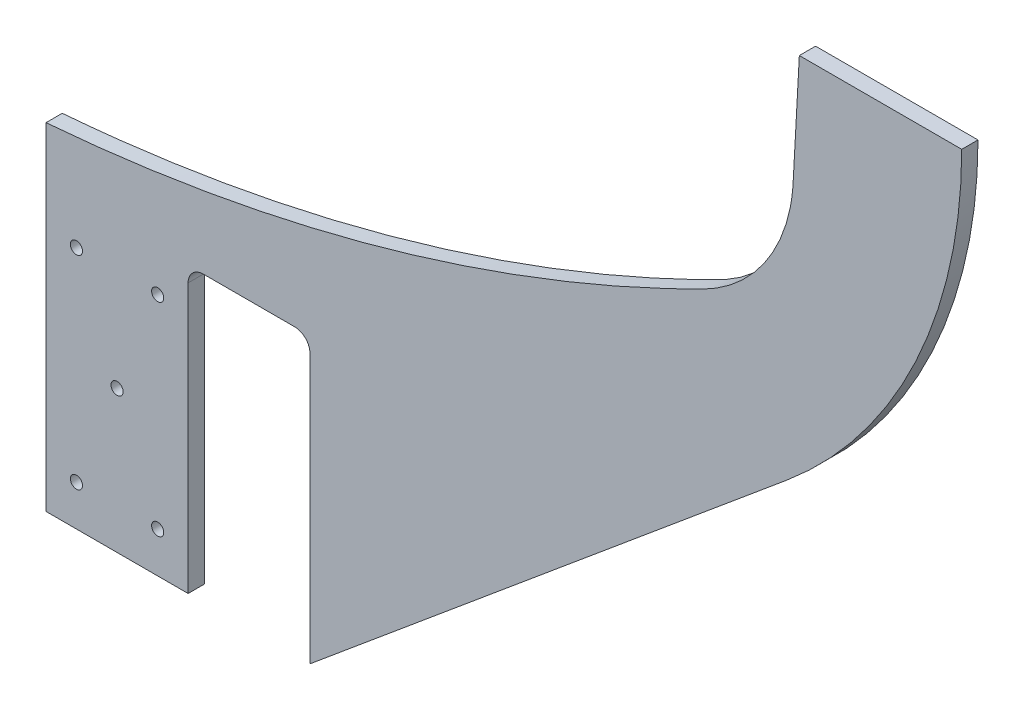
ISO-10303-21;
HEADER;
FILE_DESCRIPTION(('STEP AP214'),'2;1');
FILE_NAME('part.step','',(''),(''),'','','');
FILE_SCHEMA(('AUTOMOTIVE_DESIGN { 1 0 10303 214 1 1 1 1 }'));
ENDSEC;
DATA;
#1=APPLICATION_CONTEXT('core data for automotive mechanical design processes');
#2=APPLICATION_PROTOCOL_DEFINITION('international standard','automotive_design',2000,#1);
#3=PRODUCT_CONTEXT('',#1,'mechanical');
#4=PRODUCT('Part','Part','',(#3));
#5=PRODUCT_RELATED_PRODUCT_CATEGORY('part','',(#4));
#6=PRODUCT_DEFINITION_FORMATION('','',#4);
#7=PRODUCT_DEFINITION_CONTEXT('part definition',#1,'design');
#8=PRODUCT_DEFINITION('design','',#6,#7);
#9=PRODUCT_DEFINITION_SHAPE('','',#8);
#10=(LENGTH_UNIT() NAMED_UNIT(*) SI_UNIT(.MILLI.,.METRE.));
#11=(NAMED_UNIT(*) PLANE_ANGLE_UNIT() SI_UNIT($,.RADIAN.));
#12=(NAMED_UNIT(*) SI_UNIT($,.STERADIAN.) SOLID_ANGLE_UNIT());
#13=UNCERTAINTY_MEASURE_WITH_UNIT(LENGTH_MEASURE(1.E-05),#10,'distance_accuracy_value','');
#14=(GEOMETRIC_REPRESENTATION_CONTEXT(3) GLOBAL_UNCERTAINTY_ASSIGNED_CONTEXT((#13)) GLOBAL_UNIT_ASSIGNED_CONTEXT((#10,
#11,#12)) REPRESENTATION_CONTEXT('',''));
#15=CARTESIAN_POINT('',(0.,0.,0.));
#16=DIRECTION('',(0.,0.,1.));
#17=DIRECTION('',(1.,0.,0.));
#18=AXIS2_PLACEMENT_3D('',#15,#16,#17);
#19=CARTESIAN_POINT('',(282.822547315965,0.,172.72));
#20=CARTESIAN_POINT('',(281.917432252256,-16.716201741748,172.72));
#21=CARTESIAN_POINT('',(281.009042384406,-33.4322254897038,172.72));
#22=CARTESIAN_POINT('',(279.642521658059,-58.5060471842973,172.72));
#23=CARTESIAN_POINT('',(279.186465158858,-66.863956695634,172.72));
#24=CARTESIAN_POINT('',(278.6164879358,-77.3113479059404,172.72));
#25=CARTESIAN_POINT('',(278.44550483703,-80.4455658967186,172.72));
#26=CARTESIAN_POINT('',(278.274559114764,-83.5797862176887,172.72));
#27=CARTESIAN_POINT('',(278.160605711418,-85.6692670807608,172.72));
#28=CARTESIAN_POINT('',(278.111826830943,-86.7145185953383,172.72));
#29=CARTESIAN_POINT('',(277.933937907453,-88.8000134773418,172.72));
#30=CARTESIAN_POINT('',(277.81274561256,-89.840750466999,172.72));
#31=CARTESIAN_POINT('',(277.505129205835,-91.9181576492215,172.72));
#32=CARTESIAN_POINT('',(277.319133397582,-92.9510139970632,172.72));
#33=CARTESIAN_POINT('',(276.670317019009,-96.0123633764514,172.72));
#34=CARTESIAN_POINT('',(276.11604168694,-98.0121269853969,172.72));
#35=CARTESIAN_POINT('',(274.770500867277,-101.931569300678,172.72));
#36=CARTESIAN_POINT('',(273.97880080892,-103.851101154682,172.72));
#37=CARTESIAN_POINT('',(272.607912550155,-106.668444380845,172.72));
#38=CARTESIAN_POINT('',(272.118462854082,-107.600376740023,172.72));
#39=CARTESIAN_POINT('',(271.087513772088,-109.424466313284,172.72));
#40=CARTESIAN_POINT('',(270.546450149901,-110.316517342708,172.72));
#41=CARTESIAN_POINT('',(268.848193810457,-112.934018819833,172.72));
#42=CARTESIAN_POINT('',(267.616149058274,-114.600984423875,172.72));
#43=CARTESIAN_POINT('',(264.95365386577,-117.779893451686,172.72));
#44=CARTESIAN_POINT('',(263.523342806333,-119.291945779231,172.72));
#45=CARTESIAN_POINT('',(261.224264038492,-121.440001023838,172.72));
#46=CARTESIAN_POINT('',(260.434591495671,-122.133522085225,172.72));
#47=CARTESIAN_POINT('',(258.824774339137,-123.462748371786,172.72));
#48=CARTESIAN_POINT('',(258.002420054399,-124.100536933576,172.72));
#49=CARTESIAN_POINT('',(255.483699130975,-125.934472984522,172.72));
#50=CARTESIAN_POINT('',(253.735859311784,-127.051475124801,172.72));
#51=CARTESIAN_POINT('',(251.465022087965,-128.3154363055,172.72));
#52=CARTESIAN_POINT('',(251.006539799165,-128.561594021813,172.72));
#53=CARTESIAN_POINT('',(250.080879075368,-129.040538228532,172.72));
#54=CARTESIAN_POINT('',(249.613678067462,-129.273290010752,172.72));
#55=CARTESIAN_POINT('',(248.214811365788,-129.975752736103,172.72));
#56=CARTESIAN_POINT('',(247.280452407282,-130.441654298831,172.72));
#57=CARTESIAN_POINT('',(244.47385592022,-131.83122795591,172.72));
#58=CARTESIAN_POINT('',(242.598324524224,-132.746663613543,172.72));
#59=CARTESIAN_POINT('',(225.678493709402,-140.887444301194,172.72));
#60=CARTESIAN_POINT('',(210.355002011749,-147.428614762706,172.72));
#61=CARTESIAN_POINT('',(186.945059573838,-156.199609990324,172.72));
#62=CARTESIAN_POINT('',(179.070432736322,-158.949218628526,172.72));
#63=CARTESIAN_POINT('',(163.179835439167,-164.099264465208,172.72));
#64=CARTESIAN_POINT('',(155.204838431599,-166.486485556579,172.72));
#65=CARTESIAN_POINT('',(131.192189377069,-173.093830710618,172.72));
#66=CARTESIAN_POINT('',(115.06656409433,-176.757643415865,172.72));
#67=CARTESIAN_POINT('',(82.586333401069,-182.637280190018,172.72));
#68=CARTESIAN_POINT('',(66.2317036209634,-184.852950154366,172.72));
#69=CARTESIAN_POINT('',(33.2906371717537,-187.818426017268,172.72));
#70=CARTESIAN_POINT('',(16.7048995493728,-188.572652437908,172.72));
#71=CARTESIAN_POINT('',(0.,-188.573341344875,172.72));
#72=B_SPLINE_CURVE_WITH_KNOTS('',3,(#19,#20,#21,#22,#23,#24,#25,#26,#27,#28,#29,#30,#31,#32,#33,
#34,#35,#36,#37,#38,#39,#40,#41,#42,#43,#44,#45,#46,#47,#48,#49,#50,#51,#52,#53,#54,#55,#56,#57,
#58,#59,#60,#61,#62,#63,#64,#65,#66,#67,#68,#69,#70,#71),.UNSPECIFIED.,.F.,.F.,(4,2,2,1,2,2,2,2,
2,2,2,2,2,2,2,2,2,2,2,2,2,2,2,2,2,2,4),(0.,0.124999999999994,0.187499999999991,
0.203124999999991,0.21093749999999,0.21874999999999,0.226562499999989,0.234374999999989,
0.249999999999989,0.265624999999988,0.273437499999988,0.281249999999987,0.296874999999987,
0.312499999999986,0.320312499999986,0.328124999999986,0.343749999999986,0.347656249999986,
0.351562499999986,0.359374999999986,0.374999999999986,0.499999999999989,0.56249999999999,
0.624999999999992,0.749999999999994,0.874999999999997,1.),.UNSPECIFIED.);
#73=DIRECTION('',(0.,0.,1.));
#74=VECTOR('',#73,1.);
#75=SURFACE_OF_LINEAR_EXTRUSION('',#72,#74);
#76=CARTESIAN_POINT('',(44.4500015628081,-186.788215495495,177.8));
#77=CARTESIAN_POINT('',(46.2217234840443,-186.645798079056,177.8));
#78=CARTESIAN_POINT('',(47.9921114606454,-186.494945272647,177.8));
#79=CARTESIAN_POINT('',(66.2317036209634,-184.852950154366,177.8));
#80=CARTESIAN_POINT('',(82.586333401069,-182.637280190018,177.8));
#81=CARTESIAN_POINT('',(115.06656409433,-176.757643415865,177.8));
#82=CARTESIAN_POINT('',(131.192189377069,-173.093830710618,177.8));
#83=CARTESIAN_POINT('',(155.204838431599,-166.486485556579,177.8));
#84=CARTESIAN_POINT('',(163.179835439167,-164.099264465208,177.8));
#85=CARTESIAN_POINT('',(179.070432736322,-158.949218628526,177.8));
#86=CARTESIAN_POINT('',(186.945059573838,-156.199609990324,177.8));
#87=CARTESIAN_POINT('',(210.355002011749,-147.428614762706,177.8));
#88=CARTESIAN_POINT('',(225.678493709402,-140.887444301194,177.8));
#89=CARTESIAN_POINT('',(242.598324524224,-132.746663613543,177.8));
#90=CARTESIAN_POINT('',(244.47385592022,-131.83122795591,177.8));
#91=CARTESIAN_POINT('',(247.280452407282,-130.441654298831,177.8));
#92=CARTESIAN_POINT('',(248.214811365788,-129.975752736103,177.8));
#93=CARTESIAN_POINT('',(249.613678067462,-129.273290010752,177.8));
#94=CARTESIAN_POINT('',(250.080879075368,-129.040538228532,177.8));
#95=CARTESIAN_POINT('',(251.006539799165,-128.561594021813,177.8));
#96=CARTESIAN_POINT('',(251.465022087965,-128.3154363055,177.8));
#97=CARTESIAN_POINT('',(253.735859311784,-127.051475124801,177.8));
#98=CARTESIAN_POINT('',(255.483699130975,-125.934472984522,177.8));
#99=CARTESIAN_POINT('',(258.002420054399,-124.100536933576,177.8));
#100=CARTESIAN_POINT('',(258.824774339137,-123.462748371786,177.8));
#101=CARTESIAN_POINT('',(260.434591495671,-122.133522085225,177.8));
#102=CARTESIAN_POINT('',(261.224264038492,-121.440001023838,177.8));
#103=CARTESIAN_POINT('',(263.523342806333,-119.291945779231,177.8));
#104=CARTESIAN_POINT('',(264.95365386577,-117.779893451686,177.8));
#105=CARTESIAN_POINT('',(267.616149058274,-114.600984423875,177.8));
#106=CARTESIAN_POINT('',(268.848193810457,-112.934018819833,177.8));
#107=CARTESIAN_POINT('',(270.546450149901,-110.316517342708,177.8));
#108=CARTESIAN_POINT('',(271.087513772088,-109.424466313284,177.8));
#109=CARTESIAN_POINT('',(272.118462854082,-107.600376740023,177.8));
#110=CARTESIAN_POINT('',(272.607912550155,-106.668444380845,177.8));
#111=CARTESIAN_POINT('',(273.97880080892,-103.851101154682,177.8));
#112=CARTESIAN_POINT('',(274.770500867277,-101.931569300678,177.8));
#113=CARTESIAN_POINT('',(276.11604168694,-98.0121269853969,177.8));
#114=CARTESIAN_POINT('',(276.670317019009,-96.0123633764514,177.8));
#115=CARTESIAN_POINT('',(277.319133397582,-92.9510139970632,177.8));
#116=CARTESIAN_POINT('',(277.505129205835,-91.9181576492215,177.8));
#117=CARTESIAN_POINT('',(277.81274561256,-89.840750466999,177.8));
#118=CARTESIAN_POINT('',(277.933937907453,-88.8000134773418,177.8));
#119=CARTESIAN_POINT('',(278.111826830943,-86.7145185953383,177.8));
#120=CARTESIAN_POINT('',(278.160605711418,-85.6692670807608,177.8));
#121=CARTESIAN_POINT('',(278.274559114764,-83.5797862176887,177.8));
#122=CARTESIAN_POINT('',(278.44550483703,-80.4455658967186,177.8));
#123=CARTESIAN_POINT('',(278.6164879358,-77.3113479059404,177.8));
#124=CARTESIAN_POINT('',(279.174610104009,-67.0812537924612,177.8));
#125=CARTESIAN_POINT('',(279.618807713543,-58.9406412005363,177.8));
#126=CARTESIAN_POINT('',(280.062499337146,-50.8,177.8));
#127=B_SPLINE_CURVE_WITH_KNOTS('',3,(#76,#77,#78,#79,#80,#81,#82,#83,#84,#85,#86,#87,#88,#89,
#90,#91,#92,#93,#94,#95,#96,#97,#98,#99,#100,#101,#102,#103,#104,#105,#106,#107,#108,#109,#110,
#111,#112,#113,#114,#115,#116,#117,#118,#119,#120,#121,#122,#123,#124,#125,#126),.UNSPECIFIED.,
.F.,.F.,(4,2,2,2,2,2,2,2,2,2,2,2,2,2,2,2,2,2,2,2,2,2,2,1,2,4),(0.126624935387967,
0.140050873938263,0.265050873938265,0.390050873938268,0.45255087393827,0.515050873938271,
0.640050873938273,0.655675873938274,0.663488373938274,0.667394623938274,0.671300873938274,
0.686925873938274,0.694738373938274,0.702550873938273,0.718175873938273,0.733800873938272,
0.741613373938272,0.749425873938272,0.765050873938271,0.780675873938271,0.78848837393827,
0.79630087393827,0.80411337393827,0.811925873938269,0.827550873938268,0.888425938550293),.UNSPECIFIED.);
#128=CARTESIAN_POINT('',(280.062499337146,-50.8,177.8));
#129=VERTEX_POINT('',#128);
#130=CARTESIAN_POINT('',(44.4500015628102,-186.788215495495,177.8));
#131=VERTEX_POINT('',#130);
#132=EDGE_CURVE('E130',#129,#131,#127,.F.);
#133=ORIENTED_EDGE('',*,*,#132,.F.);
#134=DIRECTION('',(0.,0.,1.));
#135=VECTOR('',#134,1.);
#136=CARTESIAN_POINT('',(280.062499337146,-50.8,172.72));
#137=LINE('',#136,#135);
#138=CARTESIAN_POINT('',(280.062499337146,-50.8,172.72));
#139=VERTEX_POINT('',#138);
#140=EDGE_CURVE('E123',#139,#129,#137,.T.);
#141=ORIENTED_EDGE('',*,*,#140,.F.);
#142=CARTESIAN_POINT('',(280.062499337146,-50.8,172.72));
#143=CARTESIAN_POINT('',(279.618807713543,-58.9406412005363,172.72));
#144=CARTESIAN_POINT('',(279.174610104009,-67.0812537924612,172.72));
#145=CARTESIAN_POINT('',(278.6164879358,-77.3113479059404,172.72));
#146=CARTESIAN_POINT('',(278.44550483703,-80.4455658967186,172.72));
#147=CARTESIAN_POINT('',(278.274559114764,-83.5797862176887,172.72));
#148=CARTESIAN_POINT('',(278.160605711418,-85.6692670807608,172.72));
#149=CARTESIAN_POINT('',(278.111826830943,-86.7145185953383,172.72));
#150=CARTESIAN_POINT('',(277.933937907453,-88.8000134773418,172.72));
#151=CARTESIAN_POINT('',(277.81274561256,-89.840750466999,172.72));
#152=CARTESIAN_POINT('',(277.505129205835,-91.9181576492215,172.72));
#153=CARTESIAN_POINT('',(277.319133397582,-92.9510139970632,172.72));
#154=CARTESIAN_POINT('',(276.670317019009,-96.0123633764514,172.72));
#155=CARTESIAN_POINT('',(276.11604168694,-98.0121269853969,172.72));
#156=CARTESIAN_POINT('',(274.770500867277,-101.931569300678,172.72));
#157=CARTESIAN_POINT('',(273.97880080892,-103.851101154682,172.72));
#158=CARTESIAN_POINT('',(272.607912550155,-106.668444380845,172.72));
#159=CARTESIAN_POINT('',(272.118462854082,-107.600376740023,172.72));
#160=CARTESIAN_POINT('',(271.087513772088,-109.424466313284,172.72));
#161=CARTESIAN_POINT('',(270.546450149901,-110.316517342708,172.72));
#162=CARTESIAN_POINT('',(268.848193810457,-112.934018819833,172.72));
#163=CARTESIAN_POINT('',(267.616149058274,-114.600984423875,172.72));
#164=CARTESIAN_POINT('',(264.95365386577,-117.779893451686,172.72));
#165=CARTESIAN_POINT('',(263.523342806333,-119.291945779231,172.72));
#166=CARTESIAN_POINT('',(261.224264038492,-121.440001023838,172.72));
#167=CARTESIAN_POINT('',(260.434591495671,-122.133522085225,172.72));
#168=CARTESIAN_POINT('',(258.824774339137,-123.462748371786,172.72));
#169=CARTESIAN_POINT('',(258.002420054399,-124.100536933576,172.72));
#170=CARTESIAN_POINT('',(255.483699130975,-125.934472984522,172.72));
#171=CARTESIAN_POINT('',(253.735859311784,-127.051475124801,172.72));
#172=CARTESIAN_POINT('',(251.465022087965,-128.3154363055,172.72));
#173=CARTESIAN_POINT('',(251.006539799165,-128.561594021813,172.72));
#174=CARTESIAN_POINT('',(250.080879075368,-129.040538228532,172.72));
#175=CARTESIAN_POINT('',(249.613678067462,-129.273290010752,172.72));
#176=CARTESIAN_POINT('',(248.214811365788,-129.975752736103,172.72));
#177=CARTESIAN_POINT('',(247.280452407282,-130.441654298831,172.72));
#178=CARTESIAN_POINT('',(244.47385592022,-131.83122795591,172.72));
#179=CARTESIAN_POINT('',(242.598324524224,-132.746663613543,172.72));
#180=CARTESIAN_POINT('',(225.678493709402,-140.887444301194,172.72));
#181=CARTESIAN_POINT('',(210.355002011749,-147.428614762706,172.72));
#182=CARTESIAN_POINT('',(186.945059573838,-156.199609990324,172.72));
#183=CARTESIAN_POINT('',(179.070432736322,-158.949218628526,172.72));
#184=CARTESIAN_POINT('',(163.179835439167,-164.099264465208,172.72));
#185=CARTESIAN_POINT('',(155.204838431599,-166.486485556579,172.72));
#186=CARTESIAN_POINT('',(131.192189377069,-173.093830710618,172.72));
#187=CARTESIAN_POINT('',(115.06656409433,-176.757643415865,172.72));
#188=CARTESIAN_POINT('',(82.586333401069,-182.637280190018,172.72));
#189=CARTESIAN_POINT('',(66.2317036209634,-184.852950154366,172.72));
#190=CARTESIAN_POINT('',(47.9921114606454,-186.494945272647,172.72));
#191=CARTESIAN_POINT('',(46.2217234840443,-186.645798079056,172.72));
#192=CARTESIAN_POINT('',(44.4500015628081,-186.788215495495,172.72));
#193=B_SPLINE_CURVE_WITH_KNOTS('',3,(#142,#143,#144,#145,#146,#147,#148,#149,#150,#151,#152,
#153,#154,#155,#156,#157,#158,#159,#160,#161,#162,#163,#164,#165,#166,#167,#168,#169,#170,#171,
#172,#173,#174,#175,#176,#177,#178,#179,#180,#181,#182,#183,#184,#185,#186,#187,#188,#189,#190,
#191,#192),.UNSPECIFIED.,.F.,.F.,(4,2,1,2,2,2,2,2,2,2,2,2,2,2,2,2,2,2,2,2,2,2,2,2,2,4),
(0.126624935387967,0.187499999999991,0.203124999999991,0.21093749999999,0.21874999999999,
0.226562499999989,0.234374999999989,0.249999999999989,0.265624999999988,0.273437499999988,
0.281249999999987,0.296874999999987,0.312499999999986,0.320312499999986,0.328124999999986,
0.343749999999986,0.347656249999986,0.351562499999986,0.359374999999986,0.374999999999986,
0.499999999999989,0.56249999999999,0.624999999999992,0.749999999999994,0.874999999999997,
0.888425938550293),.UNSPECIFIED.);
#194=CARTESIAN_POINT('',(44.4500015628102,-186.788215495495,172.72));
#195=VERTEX_POINT('',#194);
#196=EDGE_CURVE('E126',#139,#195,#193,.T.);
#197=ORIENTED_EDGE('',*,*,#196,.T.);
#198=DIRECTION('',(0.,0.,1.));
#199=VECTOR('',#198,1.);
#200=CARTESIAN_POINT('',(44.4500015628102,-186.788215495495,172.72));
#201=LINE('',#200,#199);
#202=EDGE_CURVE('E246',#195,#131,#201,.T.);
#203=ORIENTED_EDGE('',*,*,#202,.T.);
#204=EDGE_LOOP('',(#133,#141,#197,#203));
#205=FACE_BOUND('',#204,.T.);
#206=ADVANCED_FACE('F41',(#205),#75,.T.);
#207=CARTESIAN_POINT('',(0.,-50.8,172.72));
#208=DIRECTION('',(0.,-1.,0.));
#209=DIRECTION('',(0.,0.,-1.));
#210=AXIS2_PLACEMENT_3D('',#207,#208,#209);
#211=PLANE('',#210);
#212=DIRECTION('',(1.,0.,0.));
#213=VECTOR('',#212,1.);
#214=CARTESIAN_POINT('',(0.,-50.8,177.8));
#215=LINE('',#214,#213);
#216=CARTESIAN_POINT('',(330.862499337146,-50.8,177.8));
#217=VERTEX_POINT('',#216);
#218=EDGE_CURVE('E191',#129,#217,#215,.T.);
#219=ORIENTED_EDGE('',*,*,#218,.T.);
#220=DIRECTION('',(0.,0.,1.));
#221=VECTOR('',#220,1.);
#222=CARTESIAN_POINT('',(330.862499337146,-50.8,172.72));
#223=LINE('',#222,#221);
#224=CARTESIAN_POINT('',(330.862499337146,-50.8,172.72));
#225=VERTEX_POINT('',#224);
#226=EDGE_CURVE('E135',#225,#217,#223,.T.);
#227=ORIENTED_EDGE('',*,*,#226,.F.);
#228=DIRECTION('',(1.,0.,0.));
#229=VECTOR('',#228,1.);
#230=CARTESIAN_POINT('',(0.,-50.8,172.72));
#231=LINE('',#230,#229);
#232=EDGE_CURVE('E138',#139,#225,#231,.T.);
#233=ORIENTED_EDGE('',*,*,#232,.F.);
#234=ORIENTED_EDGE('',*,*,#140,.T.);
#235=EDGE_LOOP('',(#219,#227,#233,#234));
#236=FACE_BOUND('',#235,.T.);
#237=ADVANCED_FACE('F139',(#236),#211,.F.);
#238=CARTESIAN_POINT('',(178.462499337146,-50.8,172.72));
#239=DIRECTION('',(0.,0.,1.));
#240=DIRECTION('',(1.,0.,0.));
#241=AXIS2_PLACEMENT_3D('',#238,#239,#240);
#242=CYLINDRICAL_SURFACE('',#241,152.4);
#243=CARTESIAN_POINT('',(178.462499337146,-50.8,177.8));
#244=DIRECTION('',(0.,0.,-1.));
#245=DIRECTION('',(-1.,0.,0.));
#246=AXIS2_PLACEMENT_3D('',#243,#244,#245);
#247=CIRCLE('',#246,152.4);
#248=CARTESIAN_POINT('',(276.042474902524,-167.863693640087,177.8));
#249=VERTEX_POINT('',#248);
#250=EDGE_CURVE('E227',#217,#249,#247,.T.);
#251=ORIENTED_EDGE('',*,*,#250,.T.);
#252=DIRECTION('',(0.,0.,1.));
#253=VECTOR('',#252,1.);
#254=CARTESIAN_POINT('',(276.042474902524,-167.863693640087,172.72));
#255=LINE('',#254,#253);
#256=CARTESIAN_POINT('',(276.042474902524,-167.863693640087,172.72));
#257=VERTEX_POINT('',#256);
#258=EDGE_CURVE('E252',#257,#249,#255,.T.);
#259=ORIENTED_EDGE('',*,*,#258,.F.);
#260=CARTESIAN_POINT('',(178.462499337146,-50.8,172.72));
#261=DIRECTION('',(0.,0.,-1.));
#262=DIRECTION('',(-1.,0.,0.));
#263=AXIS2_PLACEMENT_3D('',#260,#261,#262);
#264=CIRCLE('',#263,152.4);
#265=EDGE_CURVE('E142',#225,#257,#264,.T.);
#266=ORIENTED_EDGE('',*,*,#265,.F.);
#267=ORIENTED_EDGE('',*,*,#226,.T.);
#268=EDGE_LOOP('',(#251,#259,#266,#267));
#269=FACE_BOUND('',#268,.T.);
#270=ADVANCED_FACE('F256',(#269),#242,.T.);
#271=CARTESIAN_POINT('',(195.728992716508,-234.810048958216,172.72));
#272=DIRECTION('',(0.640288553578599,-0.768134472703983,0.));
#273=DIRECTION('',(0.768134472703983,0.640288553578599,0.));
#274=AXIS2_PLACEMENT_3D('',#271,#272,#273);
#275=PLANE('',#274);
#276=DIRECTION('',(0.768134472703983,0.640288553578599,0.));
#277=VECTOR('',#276,1.);
#278=CARTESIAN_POINT('',(195.728992716508,-234.810048958216,177.8));
#279=LINE('',#278,#277);
#280=CARTESIAN_POINT('',(127.00000156281,-292.1,177.8));
#281=VERTEX_POINT('',#280);
#282=EDGE_CURVE('E230',#281,#249,#279,.T.);
#283=ORIENTED_EDGE('',*,*,#282,.F.);
#284=DIRECTION('',(0.,0.,1.));
#285=VECTOR('',#284,1.);
#286=CARTESIAN_POINT('',(127.00000156281,-292.1,172.72));
#287=LINE('',#286,#285);
#288=CARTESIAN_POINT('',(127.00000156281,-292.1,172.72));
#289=VERTEX_POINT('',#288);
#290=EDGE_CURVE('E249',#289,#281,#287,.T.);
#291=ORIENTED_EDGE('',*,*,#290,.F.);
#292=DIRECTION('',(0.768134472703983,0.640288553578599,0.));
#293=VECTOR('',#292,1.);
#294=CARTESIAN_POINT('',(195.728992716508,-234.810048958216,172.72));
#295=LINE('',#294,#293);
#296=EDGE_CURVE('E216',#289,#257,#295,.T.);
#297=ORIENTED_EDGE('',*,*,#296,.T.);
#298=ORIENTED_EDGE('',*,*,#258,.T.);
#299=EDGE_LOOP('',(#283,#291,#297,#298));
#300=FACE_BOUND('',#299,.T.);
#301=ADVANCED_FACE('F263',(#300),#275,.T.);
#302=CARTESIAN_POINT('',(127.00000156281,0.,172.72));
#303=DIRECTION('',(-1.,0.,0.));
#304=DIRECTION('',(0.,0.,1.));
#305=AXIS2_PLACEMENT_3D('',#302,#303,#304);
#306=PLANE('',#305);
#307=DIRECTION('',(0.,-1.,0.));
#308=VECTOR('',#307,1.);
#309=CARTESIAN_POINT('',(127.00000156281,0.,177.8));
#310=LINE('',#309,#308);
#311=CARTESIAN_POINT('',(127.00000156281,-207.9625,177.8));
#312=VERTEX_POINT('',#311);
#313=EDGE_CURVE('E233',#312,#281,#310,.T.);
#314=ORIENTED_EDGE('',*,*,#313,.F.);
#315=DIRECTION('',(0.,0.,1.));
#316=VECTOR('',#315,1.);
#317=CARTESIAN_POINT('',(127.00000156281,-207.9625,172.72));
#318=LINE('',#317,#316);
#319=CARTESIAN_POINT('',(127.00000156281,-207.9625,172.72));
#320=VERTEX_POINT('',#319);
#321=EDGE_CURVE('E273',#312,#320,#318,.F.);
#322=ORIENTED_EDGE('',*,*,#321,.T.);
#323=DIRECTION('',(0.,-1.,0.));
#324=VECTOR('',#323,1.);
#325=CARTESIAN_POINT('',(127.00000156281,0.,172.72));
#326=LINE('',#325,#324);
#327=EDGE_CURVE('E219',#320,#289,#326,.T.);
#328=ORIENTED_EDGE('',*,*,#327,.T.);
#329=ORIENTED_EDGE('',*,*,#290,.T.);
#330=EDGE_LOOP('',(#314,#322,#328,#329));
#331=FACE_BOUND('',#330,.T.);
#332=ADVANCED_FACE('F413',(#331),#306,.T.);
#333=CARTESIAN_POINT('',(0.,-203.2,172.72));
#334=DIRECTION('',(0.,1.,0.));
#335=DIRECTION('',(0.,0.,1.));
#336=AXIS2_PLACEMENT_3D('',#333,#334,#335);
#337=PLANE('',#336);
#338=DIRECTION('',(-1.,0.,0.));
#339=VECTOR('',#338,1.);
#340=CARTESIAN_POINT('',(0.,-203.2,172.72));
#341=LINE('',#340,#339);
#342=CARTESIAN_POINT('',(122.23750156281,-203.2,172.72));
#343=VERTEX_POINT('',#342);
#344=CARTESIAN_POINT('',(93.6625015628102,-203.2,172.72));
#345=VERTEX_POINT('',#344);
#346=EDGE_CURVE('E221',#343,#345,#341,.T.);
#347=ORIENTED_EDGE('',*,*,#346,.F.);
#348=DIRECTION('',(0.,0.,1.));
#349=VECTOR('',#348,1.);
#350=CARTESIAN_POINT('',(122.23750156281,-203.2,172.72));
#351=LINE('',#350,#349);
#352=CARTESIAN_POINT('',(122.23750156281,-203.2,177.8));
#353=VERTEX_POINT('',#352);
#354=EDGE_CURVE('E275',#343,#353,#351,.T.);
#355=ORIENTED_EDGE('',*,*,#354,.T.);
#356=DIRECTION('',(-1.,0.,0.));
#357=VECTOR('',#356,1.);
#358=CARTESIAN_POINT('',(0.,-203.2,177.8));
#359=LINE('',#358,#357);
#360=CARTESIAN_POINT('',(93.6625015628102,-203.2,177.8));
#361=VERTEX_POINT('',#360);
#362=EDGE_CURVE('E235',#353,#361,#359,.T.);
#363=ORIENTED_EDGE('',*,*,#362,.T.);
#364=DIRECTION('',(0.,0.,1.));
#365=VECTOR('',#364,1.);
#366=CARTESIAN_POINT('',(93.6625015628102,-203.2,172.72));
#367=LINE('',#366,#365);
#368=EDGE_CURVE('E134',#361,#345,#367,.F.);
#369=ORIENTED_EDGE('',*,*,#368,.T.);
#370=EDGE_LOOP('',(#347,#355,#363,#369));
#371=FACE_BOUND('',#370,.T.);
#372=ADVANCED_FACE('F302',(#371),#337,.F.);
#373=CARTESIAN_POINT('',(88.9000015628102,0.,172.72));
#374=DIRECTION('',(-1.,0.,0.));
#375=DIRECTION('',(0.,-1.,0.));
#376=AXIS2_PLACEMENT_3D('',#373,#374,#375);
#377=PLANE('',#376);
#378=DIRECTION('',(0.,-1.,0.));
#379=VECTOR('',#378,1.);
#380=CARTESIAN_POINT('',(88.9000015628102,0.,172.72));
#381=LINE('',#380,#379);
#382=CARTESIAN_POINT('',(88.9000015628102,-207.9625,172.72));
#383=VERTEX_POINT('',#382);
#384=CARTESIAN_POINT('',(88.9000015628102,-292.1,172.72));
#385=VERTEX_POINT('',#384);
#386=EDGE_CURVE('E223',#383,#385,#381,.T.);
#387=ORIENTED_EDGE('',*,*,#386,.F.);
#388=DIRECTION('',(0.,0.,1.));
#389=VECTOR('',#388,1.);
#390=CARTESIAN_POINT('',(88.9000015628102,-207.9625,177.8));
#391=LINE('',#390,#389);
#392=CARTESIAN_POINT('',(88.9000015628102,-207.9625,177.8));
#393=VERTEX_POINT('',#392);
#394=EDGE_CURVE('E278',#383,#393,#391,.T.);
#395=ORIENTED_EDGE('',*,*,#394,.T.);
#396=DIRECTION('',(0.,-1.,0.));
#397=VECTOR('',#396,1.);
#398=CARTESIAN_POINT('',(88.9000015628102,0.,177.8));
#399=LINE('',#398,#397);
#400=CARTESIAN_POINT('',(88.9000015628102,-292.1,177.8));
#401=VERTEX_POINT('',#400);
#402=EDGE_CURVE('E238',#393,#401,#399,.T.);
#403=ORIENTED_EDGE('',*,*,#402,.T.);
#404=DIRECTION('',(0.,0.,1.));
#405=VECTOR('',#404,1.);
#406=CARTESIAN_POINT('',(88.9000015628102,-292.1,172.72));
#407=LINE('',#406,#405);
#408=EDGE_CURVE('E245',#385,#401,#407,.T.);
#409=ORIENTED_EDGE('',*,*,#408,.F.);
#410=EDGE_LOOP('',(#387,#395,#403,#409));
#411=FACE_BOUND('',#410,.T.);
#412=ADVANCED_FACE('F299',(#411),#377,.F.);
#413=CARTESIAN_POINT('',(0.,-292.1,172.72));
#414=DIRECTION('',(0.,1.,0.));
#415=DIRECTION('',(0.,0.,1.));
#416=AXIS2_PLACEMENT_3D('',#413,#414,#415);
#417=PLANE('',#416);
#418=DIRECTION('',(-1.,0.,0.));
#419=VECTOR('',#418,1.);
#420=CARTESIAN_POINT('',(0.,-292.1,177.8));
#421=LINE('',#420,#419);
#422=CARTESIAN_POINT('',(44.4500015628102,-292.1,177.8));
#423=VERTEX_POINT('',#422);
#424=EDGE_CURVE('E240',#401,#423,#421,.T.);
#425=ORIENTED_EDGE('',*,*,#424,.T.);
#426=DIRECTION('',(0.,0.,1.));
#427=VECTOR('',#426,1.);
#428=CARTESIAN_POINT('',(44.4500015628102,-292.1,172.72));
#429=LINE('',#428,#427);
#430=CARTESIAN_POINT('',(44.4500015628102,-292.1,172.72));
#431=VERTEX_POINT('',#430);
#432=EDGE_CURVE('E243',#431,#423,#429,.T.);
#433=ORIENTED_EDGE('',*,*,#432,.F.);
#434=DIRECTION('',(-1.,0.,0.));
#435=VECTOR('',#434,1.);
#436=CARTESIAN_POINT('',(0.,-292.1,172.72));
#437=LINE('',#436,#435);
#438=EDGE_CURVE('E225',#385,#431,#437,.T.);
#439=ORIENTED_EDGE('',*,*,#438,.F.);
#440=ORIENTED_EDGE('',*,*,#408,.T.);
#441=EDGE_LOOP('',(#425,#433,#439,#440));
#442=FACE_BOUND('',#441,.T.);
#443=ADVANCED_FACE('F296',(#442),#417,.F.);
#444=CARTESIAN_POINT('',(44.4500015628102,0.,172.72));
#445=DIRECTION('',(-1.,0.,0.));
#446=DIRECTION('',(0.,0.,1.));
#447=AXIS2_PLACEMENT_3D('',#444,#445,#446);
#448=PLANE('',#447);
#449=DIRECTION('',(0.,-1.,0.));
#450=VECTOR('',#449,1.);
#451=CARTESIAN_POINT('',(44.4500015628102,0.,177.8));
#452=LINE('',#451,#450);
#453=EDGE_CURVE('E148',#131,#423,#452,.T.);
#454=ORIENTED_EDGE('',*,*,#453,.F.);
#455=ORIENTED_EDGE('',*,*,#202,.F.);
#456=DIRECTION('',(0.,-1.,0.));
#457=VECTOR('',#456,1.);
#458=CARTESIAN_POINT('',(44.4500015628102,0.,172.72));
#459=LINE('',#458,#457);
#460=EDGE_CURVE('E147',#195,#431,#459,.T.);
#461=ORIENTED_EDGE('',*,*,#460,.T.);
#462=ORIENTED_EDGE('',*,*,#432,.T.);
#463=EDGE_LOOP('',(#454,#455,#461,#462));
#464=FACE_BOUND('',#463,.T.);
#465=ADVANCED_FACE('F168',(#464),#448,.T.);
#466=CARTESIAN_POINT('',(0.,0.,172.72));
#467=DIRECTION('',(0.,0.,-1.));
#468=DIRECTION('',(-1.,0.,0.));
#469=AXIS2_PLACEMENT_3D('',#466,#467,#468);
#470=PLANE('',#469);
#471=CARTESIAN_POINT('',(66.6750015628102,-247.65,172.72));
#472=DIRECTION('',(0.,0.,-1.));
#473=DIRECTION('',(-1.,0.,0.));
#474=AXIS2_PLACEMENT_3D('',#471,#472,#473);
#475=CIRCLE('',#474,1.89864999999999);
#476=CARTESIAN_POINT('',(64.7763515628102,-247.65,172.72));
#477=VERTEX_POINT('',#476);
#478=EDGE_CURVE('E363',#477,#477,#475,.T.);
#479=ORIENTED_EDGE('',*,*,#478,.F.);
#480=EDGE_LOOP('',(#479));
#481=FACE_BOUND('',#480,.T.);
#482=CARTESIAN_POINT('',(79.3750015628102,-215.9,172.72));
#483=DIRECTION('',(0.,0.,-1.));
#484=DIRECTION('',(-1.,0.,0.));
#485=AXIS2_PLACEMENT_3D('',#482,#483,#484);
#486=CIRCLE('',#485,1.89864999999999);
#487=CARTESIAN_POINT('',(77.4763515628102,-215.9,172.72));
#488=VERTEX_POINT('',#487);
#489=EDGE_CURVE('E357',#488,#488,#486,.T.);
#490=ORIENTED_EDGE('',*,*,#489,.F.);
#491=EDGE_LOOP('',(#490));
#492=FACE_BOUND('',#491,.T.);
#493=CARTESIAN_POINT('',(53.9750015628102,-279.4,172.72));
#494=DIRECTION('',(0.,0.,-1.));
#495=DIRECTION('',(-1.,0.,0.));
#496=AXIS2_PLACEMENT_3D('',#493,#494,#495);
#497=CIRCLE('',#496,1.89864999999999);
#498=CARTESIAN_POINT('',(52.0763515628102,-279.4,172.72));
#499=VERTEX_POINT('',#498);
#500=EDGE_CURVE('E340',#499,#499,#497,.T.);
#501=ORIENTED_EDGE('',*,*,#500,.F.);
#502=EDGE_LOOP('',(#501));
#503=FACE_BOUND('',#502,.T.);
#504=CARTESIAN_POINT('',(53.9750015628102,-215.9,172.72));
#505=DIRECTION('',(0.,0.,-1.));
#506=DIRECTION('',(-1.,0.,0.));
#507=AXIS2_PLACEMENT_3D('',#504,#505,#506);
#508=CIRCLE('',#507,1.89864999999999);
#509=CARTESIAN_POINT('',(52.0763515628102,-215.9,172.72));
#510=VERTEX_POINT('',#509);
#511=EDGE_CURVE('E335',#510,#510,#508,.T.);
#512=ORIENTED_EDGE('',*,*,#511,.F.);
#513=EDGE_LOOP('',(#512));
#514=FACE_BOUND('',#513,.T.);
#515=CARTESIAN_POINT('',(79.3750015628102,-279.4,172.72));
#516=DIRECTION('',(0.,0.,-1.));
#517=DIRECTION('',(-1.,0.,0.));
#518=AXIS2_PLACEMENT_3D('',#515,#516,#517);
#519=CIRCLE('',#518,1.89864999999999);
#520=CARTESIAN_POINT('',(77.4763515628102,-279.4,172.72));
#521=VERTEX_POINT('',#520);
#522=EDGE_CURVE('E210',#521,#521,#519,.T.);
#523=ORIENTED_EDGE('',*,*,#522,.F.);
#524=EDGE_LOOP('',(#523));
#525=FACE_BOUND('',#524,.T.);
#526=ORIENTED_EDGE('',*,*,#196,.F.);
#527=ORIENTED_EDGE('',*,*,#232,.T.);
#528=ORIENTED_EDGE('',*,*,#265,.T.);
#529=ORIENTED_EDGE('',*,*,#296,.F.);
#530=ORIENTED_EDGE('',*,*,#327,.F.);
#531=CARTESIAN_POINT('',(122.23750156281,-207.9625,172.72));
#532=DIRECTION('',(0.,0.,-1.));
#533=DIRECTION('',(-1.,0.,0.));
#534=AXIS2_PLACEMENT_3D('',#531,#532,#533);
#535=CIRCLE('',#534,4.7625);
#536=EDGE_CURVE('E267',#320,#343,#535,.F.);
#537=ORIENTED_EDGE('',*,*,#536,.T.);
#538=ORIENTED_EDGE('',*,*,#346,.T.);
#539=CARTESIAN_POINT('',(93.6625015628102,-207.9625,172.72));
#540=DIRECTION('',(0.,0.,-1.));
#541=DIRECTION('',(-1.,0.,0.));
#542=AXIS2_PLACEMENT_3D('',#539,#540,#541);
#543=CIRCLE('',#542,4.7625);
#544=EDGE_CURVE('E11',#345,#383,#543,.F.);
#545=ORIENTED_EDGE('',*,*,#544,.T.);
#546=ORIENTED_EDGE('',*,*,#386,.T.);
#547=ORIENTED_EDGE('',*,*,#438,.T.);
#548=ORIENTED_EDGE('',*,*,#460,.F.);
#549=EDGE_LOOP('',(#526,#527,#528,#529,#530,#537,#538,#545,#546,#547,#548));
#550=FACE_BOUND('',#549,.T.);
#551=ADVANCED_FACE('F145',(#481,#492,#503,#514,#525,#550),#470,.T.);
#552=CARTESIAN_POINT('',(0.,0.,177.8));
#553=DIRECTION('',(0.,0.,-1.));
#554=DIRECTION('',(-1.,0.,0.));
#555=AXIS2_PLACEMENT_3D('',#552,#553,#554);
#556=PLANE('',#555);
#557=CARTESIAN_POINT('',(66.6750015628102,-247.65,177.8));
#558=DIRECTION('',(0.,0.,1.));
#559=DIRECTION('',(1.,0.,0.));
#560=AXIS2_PLACEMENT_3D('',#557,#558,#559);
#561=CIRCLE('',#560,1.89864999999999);
#562=CARTESIAN_POINT('',(68.5736515628102,-247.65,177.8));
#563=VERTEX_POINT('',#562);
#564=EDGE_CURVE('E365',#563,#563,#561,.T.);
#565=ORIENTED_EDGE('',*,*,#564,.F.);
#566=EDGE_LOOP('',(#565));
#567=FACE_BOUND('',#566,.T.);
#568=CARTESIAN_POINT('',(79.3750015628102,-215.9,177.8));
#569=DIRECTION('',(0.,0.,1.));
#570=DIRECTION('',(1.,0.,0.));
#571=AXIS2_PLACEMENT_3D('',#568,#569,#570);
#572=CIRCLE('',#571,1.89864999999999);
#573=CARTESIAN_POINT('',(81.2736515628102,-215.9,177.8));
#574=VERTEX_POINT('',#573);
#575=EDGE_CURVE('E360',#574,#574,#572,.T.);
#576=ORIENTED_EDGE('',*,*,#575,.F.);
#577=EDGE_LOOP('',(#576));
#578=FACE_BOUND('',#577,.T.);
#579=CARTESIAN_POINT('',(53.9750015628102,-279.4,177.8));
#580=DIRECTION('',(0.,0.,1.));
#581=DIRECTION('',(1.,0.,0.));
#582=AXIS2_PLACEMENT_3D('',#579,#580,#581);
#583=CIRCLE('',#582,1.89864999999999);
#584=CARTESIAN_POINT('',(55.8736515628102,-279.4,177.8));
#585=VERTEX_POINT('',#584);
#586=EDGE_CURVE('E345',#585,#585,#583,.T.);
#587=ORIENTED_EDGE('',*,*,#586,.F.);
#588=EDGE_LOOP('',(#587));
#589=FACE_BOUND('',#588,.T.);
#590=CARTESIAN_POINT('',(53.9750015628102,-215.9,177.8));
#591=DIRECTION('',(0.,0.,1.));
#592=DIRECTION('',(1.,0.,0.));
#593=AXIS2_PLACEMENT_3D('',#590,#591,#592);
#594=CIRCLE('',#593,1.89864999999999);
#595=CARTESIAN_POINT('',(55.8736515628102,-215.9,177.8));
#596=VERTEX_POINT('',#595);
#597=EDGE_CURVE('E338',#596,#596,#594,.T.);
#598=ORIENTED_EDGE('',*,*,#597,.F.);
#599=EDGE_LOOP('',(#598));
#600=FACE_BOUND('',#599,.T.);
#601=CARTESIAN_POINT('',(79.3750015628102,-279.4,177.8));
#602=DIRECTION('',(0.,0.,1.));
#603=DIRECTION('',(1.,0.,0.));
#604=AXIS2_PLACEMENT_3D('',#601,#602,#603);
#605=CIRCLE('',#604,1.89864999999999);
#606=CARTESIAN_POINT('',(81.2736515628102,-279.4,177.8));
#607=VERTEX_POINT('',#606);
#608=EDGE_CURVE('E342',#607,#607,#605,.T.);
#609=ORIENTED_EDGE('',*,*,#608,.F.);
#610=EDGE_LOOP('',(#609));
#611=FACE_BOUND('',#610,.T.);
#612=ORIENTED_EDGE('',*,*,#132,.T.);
#613=ORIENTED_EDGE('',*,*,#453,.T.);
#614=ORIENTED_EDGE('',*,*,#424,.F.);
#615=ORIENTED_EDGE('',*,*,#402,.F.);
#616=CARTESIAN_POINT('',(93.6625015628102,-207.9625,177.8));
#617=DIRECTION('',(0.,0.,-1.));
#618=DIRECTION('',(-1.,0.,0.));
#619=AXIS2_PLACEMENT_3D('',#616,#617,#618);
#620=CIRCLE('',#619,4.7625);
#621=EDGE_CURVE('E49',#393,#361,#620,.T.);
#622=ORIENTED_EDGE('',*,*,#621,.T.);
#623=ORIENTED_EDGE('',*,*,#362,.F.);
#624=CARTESIAN_POINT('',(122.23750156281,-207.9625,177.8));
#625=DIRECTION('',(0.,0.,-1.));
#626=DIRECTION('',(-1.,0.,0.));
#627=AXIS2_PLACEMENT_3D('',#624,#625,#626);
#628=CIRCLE('',#627,4.7625);
#629=EDGE_CURVE('E276',#353,#312,#628,.T.);
#630=ORIENTED_EDGE('',*,*,#629,.T.);
#631=ORIENTED_EDGE('',*,*,#313,.T.);
#632=ORIENTED_EDGE('',*,*,#282,.T.);
#633=ORIENTED_EDGE('',*,*,#250,.F.);
#634=ORIENTED_EDGE('',*,*,#218,.F.);
#635=EDGE_LOOP('',(#612,#613,#614,#615,#622,#623,#630,#631,#632,#633,#634));
#636=FACE_BOUND('',#635,.T.);
#637=ADVANCED_FACE('F167',(#567,#578,#589,#600,#611,#636),#556,.F.);
#638=CARTESIAN_POINT('',(79.3750015628102,-279.4,177.8));
#639=DIRECTION('',(0.,0.,1.));
#640=DIRECTION('',(1.,0.,0.));
#641=AXIS2_PLACEMENT_3D('',#638,#639,#640);
#642=CYLINDRICAL_SURFACE('',#641,1.89864999999999);
#643=ORIENTED_EDGE('',*,*,#522,.T.);
#644=EDGE_LOOP('',(#643));
#645=FACE_BOUND('',#644,.T.);
#646=ORIENTED_EDGE('',*,*,#608,.T.);
#647=EDGE_LOOP('',(#646));
#648=FACE_BOUND('',#647,.T.);
#649=ADVANCED_FACE('F170',(#645,#648),#642,.F.);
#650=CARTESIAN_POINT('',(53.9750015628102,-215.9,177.8));
#651=DIRECTION('',(0.,0.,1.));
#652=DIRECTION('',(1.,0.,0.));
#653=AXIS2_PLACEMENT_3D('',#650,#651,#652);
#654=CYLINDRICAL_SURFACE('',#653,1.89864999999999);
#655=ORIENTED_EDGE('',*,*,#511,.T.);
#656=EDGE_LOOP('',(#655));
#657=FACE_BOUND('',#656,.T.);
#658=ORIENTED_EDGE('',*,*,#597,.T.);
#659=EDGE_LOOP('',(#658));
#660=FACE_BOUND('',#659,.T.);
#661=ADVANCED_FACE('F324',(#657,#660),#654,.F.);
#662=CARTESIAN_POINT('',(53.9750015628102,-279.4,177.8));
#663=DIRECTION('',(0.,0.,1.));
#664=DIRECTION('',(1.,0.,0.));
#665=AXIS2_PLACEMENT_3D('',#662,#663,#664);
#666=CYLINDRICAL_SURFACE('',#665,1.89864999999999);
#667=ORIENTED_EDGE('',*,*,#500,.T.);
#668=EDGE_LOOP('',(#667));
#669=FACE_BOUND('',#668,.T.);
#670=ORIENTED_EDGE('',*,*,#586,.T.);
#671=EDGE_LOOP('',(#670));
#672=FACE_BOUND('',#671,.T.);
#673=ADVANCED_FACE('F317',(#669,#672),#666,.F.);
#674=CARTESIAN_POINT('',(79.3750015628102,-215.9,177.8));
#675=DIRECTION('',(0.,0.,1.));
#676=DIRECTION('',(1.,0.,0.));
#677=AXIS2_PLACEMENT_3D('',#674,#675,#676);
#678=CYLINDRICAL_SURFACE('',#677,1.89864999999999);
#679=ORIENTED_EDGE('',*,*,#489,.T.);
#680=EDGE_LOOP('',(#679));
#681=FACE_BOUND('',#680,.T.);
#682=ORIENTED_EDGE('',*,*,#575,.T.);
#683=EDGE_LOOP('',(#682));
#684=FACE_BOUND('',#683,.T.);
#685=ADVANCED_FACE('F311',(#681,#684),#678,.F.);
#686=CARTESIAN_POINT('',(66.6750015628102,-247.65,177.8));
#687=DIRECTION('',(0.,0.,1.));
#688=DIRECTION('',(1.,0.,0.));
#689=AXIS2_PLACEMENT_3D('',#686,#687,#688);
#690=CYLINDRICAL_SURFACE('',#689,1.89864999999999);
#691=ORIENTED_EDGE('',*,*,#478,.T.);
#692=EDGE_LOOP('',(#691));
#693=FACE_BOUND('',#692,.T.);
#694=ORIENTED_EDGE('',*,*,#564,.T.);
#695=EDGE_LOOP('',(#694));
#696=FACE_BOUND('',#695,.T.);
#697=ADVANCED_FACE('F307',(#693,#696),#690,.F.);
#698=CARTESIAN_POINT('',(122.23750156281,-207.9625,172.72));
#699=DIRECTION('',(0.,0.,1.));
#700=DIRECTION('',(1.,0.,0.));
#701=AXIS2_PLACEMENT_3D('',#698,#699,#700);
#702=CYLINDRICAL_SURFACE('',#701,4.7625);
#703=ORIENTED_EDGE('',*,*,#536,.F.);
#704=ORIENTED_EDGE('',*,*,#321,.F.);
#705=ORIENTED_EDGE('',*,*,#629,.F.);
#706=ORIENTED_EDGE('',*,*,#354,.F.);
#707=EDGE_LOOP('',(#703,#704,#705,#706));
#708=FACE_BOUND('',#707,.T.);
#709=ADVANCED_FACE('F203',(#708),#702,.F.);
#710=CARTESIAN_POINT('',(93.6625015628102,-207.9625,172.72));
#711=DIRECTION('',(0.,0.,-1.));
#712=DIRECTION('',(-1.,0.,0.));
#713=AXIS2_PLACEMENT_3D('',#710,#711,#712);
#714=CYLINDRICAL_SURFACE('',#713,4.7625);
#715=ORIENTED_EDGE('',*,*,#544,.F.);
#716=ORIENTED_EDGE('',*,*,#368,.F.);
#717=ORIENTED_EDGE('',*,*,#621,.F.);
#718=ORIENTED_EDGE('',*,*,#394,.F.);
#719=EDGE_LOOP('',(#715,#716,#717,#718));
#720=FACE_BOUND('',#719,.T.);
#721=ADVANCED_FACE('F43',(#720),#714,.F.);
#722=CLOSED_SHELL('',(#206,#237,#270,#301,#332,#372,#412,#443,#465,#551,#637,#649,#661,#673,
#685,#697,#709,#721));
#723=MANIFOLD_SOLID_BREP('B2',#722);
#724=ADVANCED_BREP_SHAPE_REPRESENTATION('',(#18,#723),#14);
#725=SHAPE_DEFINITION_REPRESENTATION(#9,#724);
ENDSEC;
END-ISO-10303-21;
